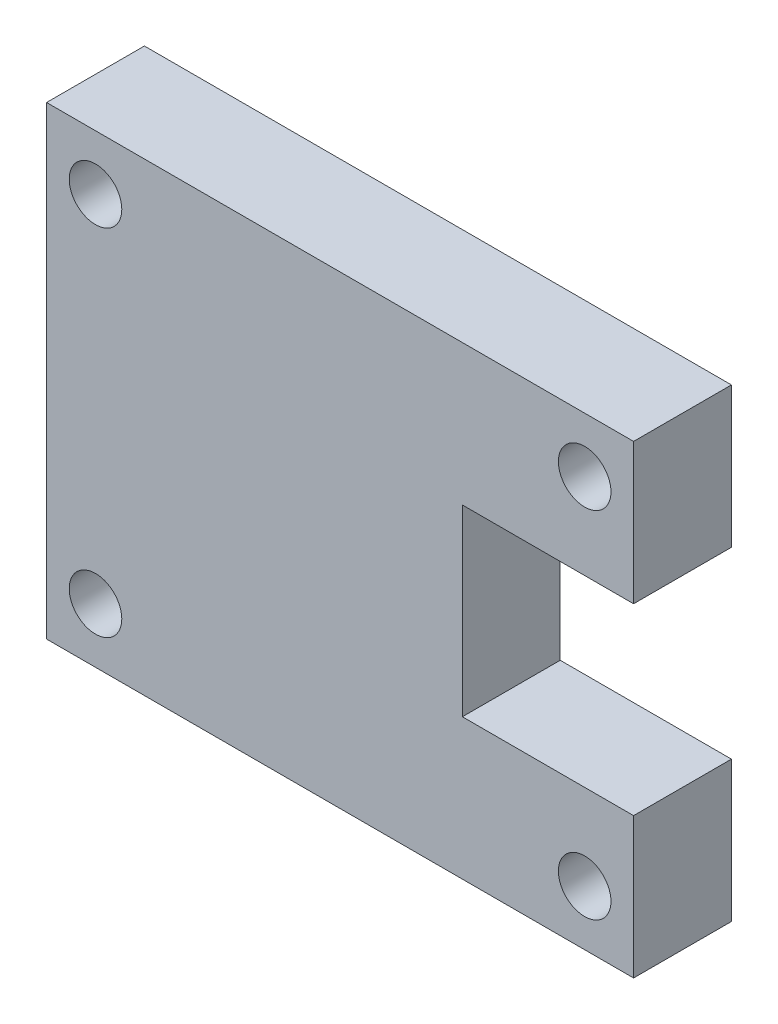
ISO-10303-21;
HEADER;
FILE_DESCRIPTION(('STEP AP214'),'2;1');
FILE_NAME('part.step','',(''),(''),'','','');
FILE_SCHEMA(('AUTOMOTIVE_DESIGN { 1 0 10303 214 1 1 1 1 }'));
ENDSEC;
DATA;
#1=APPLICATION_CONTEXT('core data for automotive mechanical design processes');
#2=APPLICATION_PROTOCOL_DEFINITION('international standard','automotive_design',2000,#1);
#3=PRODUCT_CONTEXT('',#1,'mechanical');
#4=PRODUCT('Part','Part','',(#3));
#5=PRODUCT_RELATED_PRODUCT_CATEGORY('part','',(#4));
#6=PRODUCT_DEFINITION_FORMATION('','',#4);
#7=PRODUCT_DEFINITION_CONTEXT('part definition',#1,'design');
#8=PRODUCT_DEFINITION('design','',#6,#7);
#9=PRODUCT_DEFINITION_SHAPE('','',#8);
#10=(LENGTH_UNIT() NAMED_UNIT(*) SI_UNIT(.MILLI.,.METRE.));
#11=(NAMED_UNIT(*) PLANE_ANGLE_UNIT() SI_UNIT($,.RADIAN.));
#12=(NAMED_UNIT(*) SI_UNIT($,.STERADIAN.) SOLID_ANGLE_UNIT());
#13=UNCERTAINTY_MEASURE_WITH_UNIT(LENGTH_MEASURE(1.E-05),#10,'distance_accuracy_value','');
#14=(GEOMETRIC_REPRESENTATION_CONTEXT(3) GLOBAL_UNCERTAINTY_ASSIGNED_CONTEXT((#13)) GLOBAL_UNIT_ASSIGNED_CONTEXT((#10,
#11,#12)) REPRESENTATION_CONTEXT('',''));
#15=CARTESIAN_POINT('',(0.,0.,0.));
#16=DIRECTION('',(0.,0.,1.));
#17=DIRECTION('',(1.,0.,0.));
#18=AXIS2_PLACEMENT_3D('',#15,#16,#17);
#19=CARTESIAN_POINT('',(24.,-19.,8.));
#20=DIRECTION('',(-1.,0.,0.));
#21=DIRECTION('',(0.,0.,1.));
#22=AXIS2_PLACEMENT_3D('',#19,#20,#21);
#23=PLANE('',#22);
#24=DIRECTION('',(0.,1.,0.));
#25=VECTOR('',#24,1.);
#26=CARTESIAN_POINT('',(24.,-19.,8.));
#27=LINE('',#26,#25);
#28=CARTESIAN_POINT('',(24.,7.5,8.));
#29=VERTEX_POINT('',#28);
#30=CARTESIAN_POINT('',(24.,19.,8.));
#31=VERTEX_POINT('',#30);
#32=EDGE_CURVE('E85',#29,#31,#27,.T.);
#33=ORIENTED_EDGE('',*,*,#32,.F.);
#34=DIRECTION('',(0.,0.,1.));
#35=VECTOR('',#34,1.);
#36=CARTESIAN_POINT('',(24.,7.5,0.));
#37=LINE('',#36,#35);
#38=CARTESIAN_POINT('',(24.,7.5,0.));
#39=VERTEX_POINT('',#38);
#40=EDGE_CURVE('E142',#39,#29,#37,.T.);
#41=ORIENTED_EDGE('',*,*,#40,.F.);
#42=DIRECTION('',(0.,1.,0.));
#43=VECTOR('',#42,1.);
#44=CARTESIAN_POINT('',(24.,-19.,0.));
#45=LINE('',#44,#43);
#46=CARTESIAN_POINT('',(24.,19.,0.));
#47=VERTEX_POINT('',#46);
#48=EDGE_CURVE('E141',#39,#47,#45,.T.);
#49=ORIENTED_EDGE('',*,*,#48,.T.);
#50=DIRECTION('',(0.,0.,-1.));
#51=VECTOR('',#50,1.);
#52=CARTESIAN_POINT('',(24.,19.,8.));
#53=LINE('',#52,#51);
#54=EDGE_CURVE('E11',#31,#47,#53,.T.);
#55=ORIENTED_EDGE('',*,*,#54,.F.);
#56=EDGE_LOOP('',(#33,#41,#49,#55));
#57=FACE_BOUND('',#56,.T.);
#58=ADVANCED_FACE('F32',(#57),#23,.F.);
#59=CARTESIAN_POINT('',(24.,-19.,0.));
#60=VERTEX_POINT('',#59);
#61=CARTESIAN_POINT('',(24.,-7.5,0.));
#62=VERTEX_POINT('',#61);
#63=EDGE_CURVE('E153',#60,#62,#45,.T.);
#64=ORIENTED_EDGE('',*,*,#63,.T.);
#65=DIRECTION('',(0.,0.,1.));
#66=VECTOR('',#65,1.);
#67=CARTESIAN_POINT('',(24.,-7.5,0.));
#68=LINE('',#67,#66);
#69=CARTESIAN_POINT('',(24.,-7.5,8.));
#70=VERTEX_POINT('',#69);
#71=EDGE_CURVE('E48',#62,#70,#68,.T.);
#72=ORIENTED_EDGE('',*,*,#71,.T.);
#73=CARTESIAN_POINT('',(24.,-19.,8.));
#74=VERTEX_POINT('',#73);
#75=EDGE_CURVE('E145',#74,#70,#27,.T.);
#76=ORIENTED_EDGE('',*,*,#75,.F.);
#77=DIRECTION('',(0.,0.,-1.));
#78=VECTOR('',#77,1.);
#79=CARTESIAN_POINT('',(24.,-19.,8.));
#80=LINE('',#79,#78);
#81=EDGE_CURVE('E152',#74,#60,#80,.T.);
#82=ORIENTED_EDGE('',*,*,#81,.T.);
#83=EDGE_LOOP('',(#64,#72,#76,#82));
#84=FACE_BOUND('',#83,.T.);
#85=ADVANCED_FACE('F34',(#84),#23,.F.);
#86=CARTESIAN_POINT('',(-24.,19.,8.));
#87=DIRECTION('',(0.,-1.,0.));
#88=DIRECTION('',(0.,0.,-1.));
#89=AXIS2_PLACEMENT_3D('',#86,#87,#88);
#90=PLANE('',#89);
#91=DIRECTION('',(-1.,0.,0.));
#92=VECTOR('',#91,1.);
#93=CARTESIAN_POINT('',(-24.,19.,0.));
#94=LINE('',#93,#92);
#95=CARTESIAN_POINT('',(-24.,19.,0.));
#96=VERTEX_POINT('',#95);
#97=EDGE_CURVE('E155',#47,#96,#94,.T.);
#98=ORIENTED_EDGE('',*,*,#97,.T.);
#99=DIRECTION('',(0.,0.,-1.));
#100=VECTOR('',#99,1.);
#101=CARTESIAN_POINT('',(-24.,19.,8.));
#102=LINE('',#101,#100);
#103=CARTESIAN_POINT('',(-24.,19.,8.));
#104=VERTEX_POINT('',#103);
#105=EDGE_CURVE('E41',#104,#96,#102,.T.);
#106=ORIENTED_EDGE('',*,*,#105,.F.);
#107=DIRECTION('',(-1.,0.,0.));
#108=VECTOR('',#107,1.);
#109=CARTESIAN_POINT('',(-24.,19.,8.));
#110=LINE('',#109,#108);
#111=EDGE_CURVE('E147',#31,#104,#110,.T.);
#112=ORIENTED_EDGE('',*,*,#111,.F.);
#113=ORIENTED_EDGE('',*,*,#54,.T.);
#114=EDGE_LOOP('',(#98,#106,#112,#113));
#115=FACE_BOUND('',#114,.T.);
#116=ADVANCED_FACE('F184',(#115),#90,.F.);
#117=CARTESIAN_POINT('',(-24.,-19.,8.));
#118=DIRECTION('',(1.,0.,0.));
#119=DIRECTION('',(0.,0.,-1.));
#120=AXIS2_PLACEMENT_3D('',#117,#118,#119);
#121=PLANE('',#120);
#122=DIRECTION('',(0.,-1.,0.));
#123=VECTOR('',#122,1.);
#124=CARTESIAN_POINT('',(-24.,-19.,0.));
#125=LINE('',#124,#123);
#126=CARTESIAN_POINT('',(-24.,-19.,0.));
#127=VERTEX_POINT('',#126);
#128=EDGE_CURVE('E157',#96,#127,#125,.T.);
#129=ORIENTED_EDGE('',*,*,#128,.T.);
#130=DIRECTION('',(0.,0.,-1.));
#131=VECTOR('',#130,1.);
#132=CARTESIAN_POINT('',(-24.,-19.,8.));
#133=LINE('',#132,#131);
#134=CARTESIAN_POINT('',(-24.,-19.,8.));
#135=VERTEX_POINT('',#134);
#136=EDGE_CURVE('E161',#135,#127,#133,.T.);
#137=ORIENTED_EDGE('',*,*,#136,.F.);
#138=DIRECTION('',(0.,-1.,0.));
#139=VECTOR('',#138,1.);
#140=CARTESIAN_POINT('',(-24.,-19.,8.));
#141=LINE('',#140,#139);
#142=EDGE_CURVE('E149',#104,#135,#141,.T.);
#143=ORIENTED_EDGE('',*,*,#142,.F.);
#144=ORIENTED_EDGE('',*,*,#105,.T.);
#145=EDGE_LOOP('',(#129,#137,#143,#144));
#146=FACE_BOUND('',#145,.T.);
#147=ADVANCED_FACE('F168',(#146),#121,.F.);
#148=CARTESIAN_POINT('',(-24.,-19.,8.));
#149=DIRECTION('',(0.,1.,0.));
#150=DIRECTION('',(0.,0.,1.));
#151=AXIS2_PLACEMENT_3D('',#148,#149,#150);
#152=PLANE('',#151);
#153=DIRECTION('',(1.,0.,0.));
#154=VECTOR('',#153,1.);
#155=CARTESIAN_POINT('',(-24.,-19.,0.));
#156=LINE('',#155,#154);
#157=EDGE_CURVE('E78',#127,#60,#156,.T.);
#158=ORIENTED_EDGE('',*,*,#157,.T.);
#159=ORIENTED_EDGE('',*,*,#81,.F.);
#160=DIRECTION('',(1.,0.,0.));
#161=VECTOR('',#160,1.);
#162=CARTESIAN_POINT('',(-24.,-19.,8.));
#163=LINE('',#162,#161);
#164=EDGE_CURVE('E57',#135,#74,#163,.T.);
#165=ORIENTED_EDGE('',*,*,#164,.F.);
#166=ORIENTED_EDGE('',*,*,#136,.T.);
#167=EDGE_LOOP('',(#158,#159,#165,#166));
#168=FACE_BOUND('',#167,.T.);
#169=ADVANCED_FACE('F174',(#168),#152,.F.);
#170=CARTESIAN_POINT('',(0.,0.,8.));
#171=DIRECTION('',(0.,0.,-1.));
#172=DIRECTION('',(-1.,0.,0.));
#173=AXIS2_PLACEMENT_3D('',#170,#171,#172);
#174=PLANE('',#173);
#175=CARTESIAN_POINT('',(-20.,14.5,8.));
#176=DIRECTION('',(0.,0.,1.));
#177=DIRECTION('',(1.,0.,0.));
#178=AXIS2_PLACEMENT_3D('',#175,#176,#177);
#179=CIRCLE('',#178,2.14999999999999);
#180=CARTESIAN_POINT('',(-17.85,14.5,8.));
#181=VERTEX_POINT('',#180);
#182=EDGE_CURVE('E238',#181,#181,#179,.T.);
#183=ORIENTED_EDGE('',*,*,#182,.F.);
#184=EDGE_LOOP('',(#183));
#185=FACE_BOUND('',#184,.T.);
#186=CARTESIAN_POINT('',(20.,14.5,8.));
#187=DIRECTION('',(0.,0.,1.));
#188=DIRECTION('',(1.,0.,0.));
#189=AXIS2_PLACEMENT_3D('',#186,#187,#188);
#190=CIRCLE('',#189,2.14999999999999);
#191=CARTESIAN_POINT('',(22.15,14.5,8.));
#192=VERTEX_POINT('',#191);
#193=EDGE_CURVE('E234',#192,#192,#190,.T.);
#194=ORIENTED_EDGE('',*,*,#193,.F.);
#195=EDGE_LOOP('',(#194));
#196=FACE_BOUND('',#195,.T.);
#197=CARTESIAN_POINT('',(-20.,-14.5,8.));
#198=DIRECTION('',(0.,0.,1.));
#199=DIRECTION('',(1.,0.,0.));
#200=AXIS2_PLACEMENT_3D('',#197,#198,#199);
#201=CIRCLE('',#200,2.14999999999999);
#202=CARTESIAN_POINT('',(-17.85,-14.5,8.));
#203=VERTEX_POINT('',#202);
#204=EDGE_CURVE('E229',#203,#203,#201,.T.);
#205=ORIENTED_EDGE('',*,*,#204,.F.);
#206=EDGE_LOOP('',(#205));
#207=FACE_BOUND('',#206,.T.);
#208=CARTESIAN_POINT('',(20.,-14.5,8.));
#209=DIRECTION('',(0.,0.,1.));
#210=DIRECTION('',(1.,0.,0.));
#211=AXIS2_PLACEMENT_3D('',#208,#209,#210);
#212=CIRCLE('',#211,2.14999999999999);
#213=CARTESIAN_POINT('',(22.15,-14.5,8.));
#214=VERTEX_POINT('',#213);
#215=EDGE_CURVE('E225',#214,#214,#212,.T.);
#216=ORIENTED_EDGE('',*,*,#215,.F.);
#217=EDGE_LOOP('',(#216));
#218=FACE_BOUND('',#217,.T.);
#219=DIRECTION('',(0.,-1.,0.));
#220=VECTOR('',#219,1.);
#221=CARTESIAN_POINT('',(10.,0.,8.));
#222=LINE('',#221,#220);
#223=CARTESIAN_POINT('',(10.,7.5,8.));
#224=VERTEX_POINT('',#223);
#225=CARTESIAN_POINT('',(10.,-7.5,8.));
#226=VERTEX_POINT('',#225);
#227=EDGE_CURVE('E115',#224,#226,#222,.T.);
#228=ORIENTED_EDGE('',*,*,#227,.F.);
#229=DIRECTION('',(-1.,0.,0.));
#230=VECTOR('',#229,1.);
#231=CARTESIAN_POINT('',(0.,7.5,8.));
#232=LINE('',#231,#230);
#233=EDGE_CURVE('E127',#29,#224,#232,.T.);
#234=ORIENTED_EDGE('',*,*,#233,.F.);
#235=ORIENTED_EDGE('',*,*,#32,.T.);
#236=ORIENTED_EDGE('',*,*,#111,.T.);
#237=ORIENTED_EDGE('',*,*,#142,.T.);
#238=ORIENTED_EDGE('',*,*,#164,.T.);
#239=ORIENTED_EDGE('',*,*,#75,.T.);
#240=DIRECTION('',(1.,0.,0.));
#241=VECTOR('',#240,1.);
#242=CARTESIAN_POINT('',(0.,-7.5,8.));
#243=LINE('',#242,#241);
#244=EDGE_CURVE('E130',#226,#70,#243,.T.);
#245=ORIENTED_EDGE('',*,*,#244,.F.);
#246=EDGE_LOOP('',(#228,#234,#235,#236,#237,#238,#239,#245));
#247=FACE_BOUND('',#246,.T.);
#248=ADVANCED_FACE('F176',(#185,#196,#207,#218,#247),#174,.F.);
#249=CARTESIAN_POINT('',(0.,0.,0.));
#250=DIRECTION('',(0.,0.,-1.));
#251=DIRECTION('',(-1.,0.,0.));
#252=AXIS2_PLACEMENT_3D('',#249,#250,#251);
#253=PLANE('',#252);
#254=CARTESIAN_POINT('',(-20.,14.5,0.));
#255=DIRECTION('',(0.,0.,-1.));
#256=DIRECTION('',(-1.,0.,0.));
#257=AXIS2_PLACEMENT_3D('',#254,#255,#256);
#258=CIRCLE('',#257,2.14999999999999);
#259=CARTESIAN_POINT('',(-22.15,14.5,0.));
#260=VERTEX_POINT('',#259);
#261=EDGE_CURVE('E214',#260,#260,#258,.T.);
#262=ORIENTED_EDGE('',*,*,#261,.F.);
#263=EDGE_LOOP('',(#262));
#264=FACE_BOUND('',#263,.T.);
#265=CARTESIAN_POINT('',(20.,14.5,0.));
#266=DIRECTION('',(0.,0.,-1.));
#267=DIRECTION('',(-1.,0.,0.));
#268=AXIS2_PLACEMENT_3D('',#265,#266,#267);
#269=CIRCLE('',#268,2.14999999999999);
#270=CARTESIAN_POINT('',(17.85,14.5,0.));
#271=VERTEX_POINT('',#270);
#272=EDGE_CURVE('E36',#271,#271,#269,.T.);
#273=ORIENTED_EDGE('',*,*,#272,.F.);
#274=EDGE_LOOP('',(#273));
#275=FACE_BOUND('',#274,.T.);
#276=CARTESIAN_POINT('',(-20.,-14.5,0.));
#277=DIRECTION('',(0.,0.,-1.));
#278=DIRECTION('',(-1.,0.,0.));
#279=AXIS2_PLACEMENT_3D('',#276,#277,#278);
#280=CIRCLE('',#279,2.14999999999999);
#281=CARTESIAN_POINT('',(-22.15,-14.5,0.));
#282=VERTEX_POINT('',#281);
#283=EDGE_CURVE('E221',#282,#282,#280,.T.);
#284=ORIENTED_EDGE('',*,*,#283,.F.);
#285=EDGE_LOOP('',(#284));
#286=FACE_BOUND('',#285,.T.);
#287=CARTESIAN_POINT('',(20.,-14.5,0.));
#288=DIRECTION('',(0.,0.,-1.));
#289=DIRECTION('',(-1.,0.,0.));
#290=AXIS2_PLACEMENT_3D('',#287,#288,#289);
#291=CIRCLE('',#290,2.14999999999999);
#292=CARTESIAN_POINT('',(17.85,-14.5,0.));
#293=VERTEX_POINT('',#292);
#294=EDGE_CURVE('E133',#293,#293,#291,.T.);
#295=ORIENTED_EDGE('',*,*,#294,.F.);
#296=EDGE_LOOP('',(#295));
#297=FACE_BOUND('',#296,.T.);
#298=DIRECTION('',(-1.,0.,0.));
#299=VECTOR('',#298,1.);
#300=CARTESIAN_POINT('',(0.,7.5,0.));
#301=LINE('',#300,#299);
#302=CARTESIAN_POINT('',(10.,7.5,0.));
#303=VERTEX_POINT('',#302);
#304=EDGE_CURVE('E117',#39,#303,#301,.T.);
#305=ORIENTED_EDGE('',*,*,#304,.T.);
#306=DIRECTION('',(0.,-1.,0.));
#307=VECTOR('',#306,1.);
#308=CARTESIAN_POINT('',(10.,0.,0.));
#309=LINE('',#308,#307);
#310=CARTESIAN_POINT('',(10.,-7.5,0.));
#311=VERTEX_POINT('',#310);
#312=EDGE_CURVE('E112',#303,#311,#309,.T.);
#313=ORIENTED_EDGE('',*,*,#312,.T.);
#314=DIRECTION('',(1.,0.,0.));
#315=VECTOR('',#314,1.);
#316=CARTESIAN_POINT('',(0.,-7.5,0.));
#317=LINE('',#316,#315);
#318=EDGE_CURVE('E119',#311,#62,#317,.T.);
#319=ORIENTED_EDGE('',*,*,#318,.T.);
#320=ORIENTED_EDGE('',*,*,#63,.F.);
#321=ORIENTED_EDGE('',*,*,#157,.F.);
#322=ORIENTED_EDGE('',*,*,#128,.F.);
#323=ORIENTED_EDGE('',*,*,#97,.F.);
#324=ORIENTED_EDGE('',*,*,#48,.F.);
#325=EDGE_LOOP('',(#305,#313,#319,#320,#321,#322,#323,#324));
#326=FACE_BOUND('',#325,.T.);
#327=ADVANCED_FACE('F125',(#264,#275,#286,#297,#326),#253,.T.);
#328=CARTESIAN_POINT('',(10.,0.,0.));
#329=DIRECTION('',(-1.,0.,0.));
#330=DIRECTION('',(0.,0.,1.));
#331=AXIS2_PLACEMENT_3D('',#328,#329,#330);
#332=PLANE('',#331);
#333=ORIENTED_EDGE('',*,*,#227,.T.);
#334=DIRECTION('',(0.,0.,1.));
#335=VECTOR('',#334,1.);
#336=CARTESIAN_POINT('',(10.,-7.5,0.));
#337=LINE('',#336,#335);
#338=EDGE_CURVE('E109',#311,#226,#337,.T.);
#339=ORIENTED_EDGE('',*,*,#338,.F.);
#340=ORIENTED_EDGE('',*,*,#312,.F.);
#341=DIRECTION('',(0.,0.,1.));
#342=VECTOR('',#341,1.);
#343=CARTESIAN_POINT('',(10.,7.5,0.));
#344=LINE('',#343,#342);
#345=EDGE_CURVE('E139',#303,#224,#344,.T.);
#346=ORIENTED_EDGE('',*,*,#345,.T.);
#347=EDGE_LOOP('',(#333,#339,#340,#346));
#348=FACE_BOUND('',#347,.T.);
#349=ADVANCED_FACE('F110',(#348),#332,.F.);
#350=CARTESIAN_POINT('',(0.,7.5,0.));
#351=DIRECTION('',(0.,1.,0.));
#352=DIRECTION('',(0.,0.,1.));
#353=AXIS2_PLACEMENT_3D('',#350,#351,#352);
#354=PLANE('',#353);
#355=ORIENTED_EDGE('',*,*,#233,.T.);
#356=ORIENTED_EDGE('',*,*,#345,.F.);
#357=ORIENTED_EDGE('',*,*,#304,.F.);
#358=ORIENTED_EDGE('',*,*,#40,.T.);
#359=EDGE_LOOP('',(#355,#356,#357,#358));
#360=FACE_BOUND('',#359,.T.);
#361=ADVANCED_FACE('F195',(#360),#354,.F.);
#362=CARTESIAN_POINT('',(0.,-7.5,0.));
#363=DIRECTION('',(0.,-1.,0.));
#364=DIRECTION('',(1.,0.,0.));
#365=AXIS2_PLACEMENT_3D('',#362,#363,#364);
#366=PLANE('',#365);
#367=ORIENTED_EDGE('',*,*,#244,.T.);
#368=ORIENTED_EDGE('',*,*,#71,.F.);
#369=ORIENTED_EDGE('',*,*,#318,.F.);
#370=ORIENTED_EDGE('',*,*,#338,.T.);
#371=EDGE_LOOP('',(#367,#368,#369,#370));
#372=FACE_BOUND('',#371,.T.);
#373=ADVANCED_FACE('F120',(#372),#366,.F.);
#374=CARTESIAN_POINT('',(20.,-14.5,8.));
#375=DIRECTION('',(0.,0.,1.));
#376=DIRECTION('',(1.,0.,0.));
#377=AXIS2_PLACEMENT_3D('',#374,#375,#376);
#378=CYLINDRICAL_SURFACE('',#377,2.14999999999999);
#379=ORIENTED_EDGE('',*,*,#294,.T.);
#380=EDGE_LOOP('',(#379));
#381=FACE_BOUND('',#380,.T.);
#382=ORIENTED_EDGE('',*,*,#215,.T.);
#383=EDGE_LOOP('',(#382));
#384=FACE_BOUND('',#383,.T.);
#385=ADVANCED_FACE('F202',(#381,#384),#378,.F.);
#386=CARTESIAN_POINT('',(-20.,-14.5,8.));
#387=DIRECTION('',(0.,0.,1.));
#388=DIRECTION('',(1.,0.,0.));
#389=AXIS2_PLACEMENT_3D('',#386,#387,#388);
#390=CYLINDRICAL_SURFACE('',#389,2.14999999999999);
#391=ORIENTED_EDGE('',*,*,#283,.T.);
#392=EDGE_LOOP('',(#391));
#393=FACE_BOUND('',#392,.T.);
#394=ORIENTED_EDGE('',*,*,#204,.T.);
#395=EDGE_LOOP('',(#394));
#396=FACE_BOUND('',#395,.T.);
#397=ADVANCED_FACE('F249',(#393,#396),#390,.F.);
#398=CARTESIAN_POINT('',(20.,14.5,8.));
#399=DIRECTION('',(0.,0.,1.));
#400=DIRECTION('',(1.,0.,0.));
#401=AXIS2_PLACEMENT_3D('',#398,#399,#400);
#402=CYLINDRICAL_SURFACE('',#401,2.14999999999999);
#403=ORIENTED_EDGE('',*,*,#272,.T.);
#404=EDGE_LOOP('',(#403));
#405=FACE_BOUND('',#404,.T.);
#406=ORIENTED_EDGE('',*,*,#193,.T.);
#407=EDGE_LOOP('',(#406));
#408=FACE_BOUND('',#407,.T.);
#409=ADVANCED_FACE('F251',(#405,#408),#402,.F.);
#410=CARTESIAN_POINT('',(-20.,14.5,8.));
#411=DIRECTION('',(0.,0.,1.));
#412=DIRECTION('',(1.,0.,0.));
#413=AXIS2_PLACEMENT_3D('',#410,#411,#412);
#414=CYLINDRICAL_SURFACE('',#413,2.14999999999999);
#415=ORIENTED_EDGE('',*,*,#261,.T.);
#416=EDGE_LOOP('',(#415));
#417=FACE_BOUND('',#416,.T.);
#418=ORIENTED_EDGE('',*,*,#182,.T.);
#419=EDGE_LOOP('',(#418));
#420=FACE_BOUND('',#419,.T.);
#421=ADVANCED_FACE('F242',(#417,#420),#414,.F.);
#422=CLOSED_SHELL('',(#58,#85,#116,#147,#169,#248,#327,#349,#361,#373,#385,#397,#409,#421));
#423=MANIFOLD_SOLID_BREP('B2',#422);
#424=ADVANCED_BREP_SHAPE_REPRESENTATION('',(#18,#423),#14);
#425=SHAPE_DEFINITION_REPRESENTATION(#9,#424);
ENDSEC;
END-ISO-10303-21;
